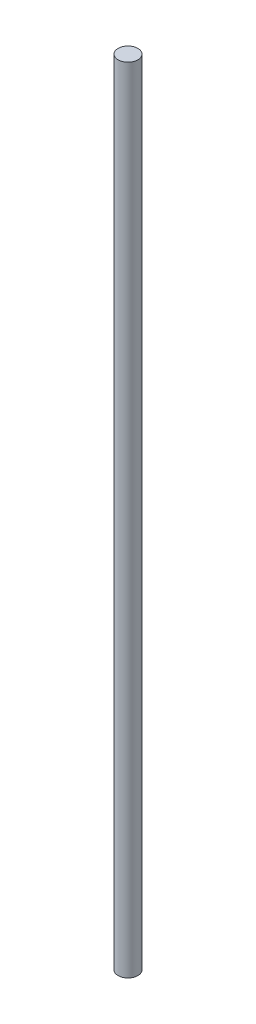
ISO-10303-21;
HEADER;
FILE_DESCRIPTION(('STEP AP214'),'2;1');
FILE_NAME('part.step','',(''),(''),'','','');
FILE_SCHEMA(('AUTOMOTIVE_DESIGN { 1 0 10303 214 1 1 1 1 }'));
ENDSEC;
DATA;
#1=APPLICATION_CONTEXT('core data for automotive mechanical design processes');
#2=APPLICATION_PROTOCOL_DEFINITION('international standard','automotive_design',2000,#1);
#3=PRODUCT_CONTEXT('',#1,'mechanical');
#4=PRODUCT('Part','Part','',(#3));
#5=PRODUCT_RELATED_PRODUCT_CATEGORY('part','',(#4));
#6=PRODUCT_DEFINITION_FORMATION('','',#4);
#7=PRODUCT_DEFINITION_CONTEXT('part definition',#1,'design');
#8=PRODUCT_DEFINITION('design','',#6,#7);
#9=PRODUCT_DEFINITION_SHAPE('','',#8);
#10=(LENGTH_UNIT() NAMED_UNIT(*) SI_UNIT(.MILLI.,.METRE.));
#11=(NAMED_UNIT(*) PLANE_ANGLE_UNIT() SI_UNIT($,.RADIAN.));
#12=(NAMED_UNIT(*) SI_UNIT($,.STERADIAN.) SOLID_ANGLE_UNIT());
#13=UNCERTAINTY_MEASURE_WITH_UNIT(LENGTH_MEASURE(1.E-05),#10,'distance_accuracy_value','');
#14=(GEOMETRIC_REPRESENTATION_CONTEXT(3) GLOBAL_UNCERTAINTY_ASSIGNED_CONTEXT((#13)) GLOBAL_UNIT_ASSIGNED_CONTEXT((#10,
#11,#12)) REPRESENTATION_CONTEXT('',''));
#15=CARTESIAN_POINT('',(0.,0.,0.));
#16=DIRECTION('',(0.,0.,1.));
#17=DIRECTION('',(1.,0.,0.));
#18=AXIS2_PLACEMENT_3D('',#15,#16,#17);
#19=CARTESIAN_POINT('',(0.,200.,0.));
#20=DIRECTION('',(0.,-1.,0.));
#21=DIRECTION('',(0.,0.,-1.));
#22=AXIS2_PLACEMENT_3D('',#19,#20,#21);
#23=CYLINDRICAL_SURFACE('',#22,5.);
#24=CARTESIAN_POINT('',(0.,200.,0.));
#25=DIRECTION('',(0.,1.,0.));
#26=DIRECTION('',(0.,0.,1.));
#27=AXIS2_PLACEMENT_3D('',#24,#25,#26);
#28=CIRCLE('',#27,5.);
#29=CARTESIAN_POINT('',(0.,200.,5.));
#30=VERTEX_POINT('',#29);
#31=EDGE_CURVE('E10',#30,#30,#28,.T.);
#32=ORIENTED_EDGE('',*,*,#31,.F.);
#33=EDGE_LOOP('',(#32));
#34=FACE_BOUND('',#33,.T.);
#35=CARTESIAN_POINT('',(0.,-200.,0.));
#36=DIRECTION('',(0.,1.,0.));
#37=DIRECTION('',(0.,0.,1.));
#38=AXIS2_PLACEMENT_3D('',#35,#36,#37);
#39=CIRCLE('',#38,5.);
#40=CARTESIAN_POINT('',(0.,-200.,5.));
#41=VERTEX_POINT('',#40);
#42=EDGE_CURVE('E44',#41,#41,#39,.T.);
#43=ORIENTED_EDGE('',*,*,#42,.T.);
#44=EDGE_LOOP('',(#43));
#45=FACE_BOUND('',#44,.T.);
#46=ADVANCED_FACE('F41',(#34,#45),#23,.T.);
#47=CARTESIAN_POINT('',(0.,200.,0.));
#48=DIRECTION('',(0.,1.,0.));
#49=DIRECTION('',(0.,0.,1.));
#50=AXIS2_PLACEMENT_3D('',#47,#48,#49);
#51=PLANE('',#50);
#52=ORIENTED_EDGE('',*,*,#31,.T.);
#53=EDGE_LOOP('',(#52));
#54=FACE_BOUND('',#53,.T.);
#55=ADVANCED_FACE('F56',(#54),#51,.T.);
#56=CARTESIAN_POINT('',(0.,-200.,0.));
#57=DIRECTION('',(0.,1.,0.));
#58=DIRECTION('',(0.,0.,1.));
#59=AXIS2_PLACEMENT_3D('',#56,#57,#58);
#60=PLANE('',#59);
#61=ORIENTED_EDGE('',*,*,#42,.F.);
#62=EDGE_LOOP('',(#61));
#63=FACE_BOUND('',#62,.T.);
#64=ADVANCED_FACE('F54',(#63),#60,.F.);
#65=CLOSED_SHELL('',(#46,#55,#64));
#66=MANIFOLD_SOLID_BREP('B2',#65);
#67=ADVANCED_BREP_SHAPE_REPRESENTATION('',(#18,#66),#14);
#68=SHAPE_DEFINITION_REPRESENTATION(#9,#67);
ENDSEC;
END-ISO-10303-21;
